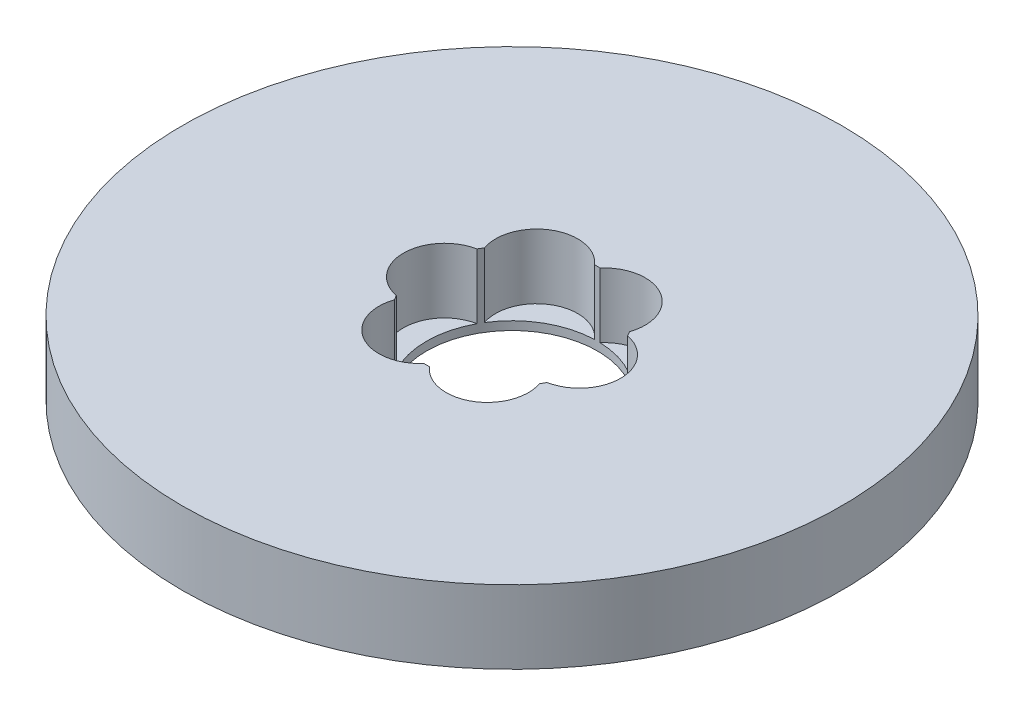
ISO-10303-21;
HEADER;
FILE_DESCRIPTION(('STEP AP214'),'2;1');
FILE_NAME('part.step','',(''),(''),'','','');
FILE_SCHEMA(('AUTOMOTIVE_DESIGN { 1 0 10303 214 1 1 1 1 }'));
ENDSEC;
DATA;
#1=APPLICATION_CONTEXT('core data for automotive mechanical design processes');
#2=APPLICATION_PROTOCOL_DEFINITION('international standard','automotive_design',2000,#1);
#3=PRODUCT_CONTEXT('',#1,'mechanical');
#4=PRODUCT('Part','Part','',(#3));
#5=PRODUCT_RELATED_PRODUCT_CATEGORY('part','',(#4));
#6=PRODUCT_DEFINITION_FORMATION('','',#4);
#7=PRODUCT_DEFINITION_CONTEXT('part definition',#1,'design');
#8=PRODUCT_DEFINITION('design','',#6,#7);
#9=PRODUCT_DEFINITION_SHAPE('','',#8);
#10=(LENGTH_UNIT() NAMED_UNIT(*) SI_UNIT(.MILLI.,.METRE.));
#11=(NAMED_UNIT(*) PLANE_ANGLE_UNIT() SI_UNIT($,.RADIAN.));
#12=(NAMED_UNIT(*) SI_UNIT($,.STERADIAN.) SOLID_ANGLE_UNIT());
#13=UNCERTAINTY_MEASURE_WITH_UNIT(LENGTH_MEASURE(1.E-05),#10,'distance_accuracy_value','');
#14=(GEOMETRIC_REPRESENTATION_CONTEXT(3) GLOBAL_UNCERTAINTY_ASSIGNED_CONTEXT((#13)) GLOBAL_UNIT_ASSIGNED_CONTEXT((#10,
#11,#12)) REPRESENTATION_CONTEXT('',''));
#15=CARTESIAN_POINT('',(0.,0.,0.));
#16=DIRECTION('',(0.,0.,1.));
#17=DIRECTION('',(1.,0.,0.));
#18=AXIS2_PLACEMENT_3D('',#15,#16,#17);
#19=CARTESIAN_POINT('',(0.,15.,0.));
#20=DIRECTION('',(0.,-1.,0.));
#21=DIRECTION('',(0.,0.,-1.));
#22=AXIS2_PLACEMENT_3D('',#19,#20,#21);
#23=CYLINDRICAL_SURFACE('',#22,67.5);
#24=CARTESIAN_POINT('',(0.,15.,0.));
#25=DIRECTION('',(0.,1.,0.));
#26=DIRECTION('',(0.,0.,1.));
#27=AXIS2_PLACEMENT_3D('',#24,#25,#26);
#28=CIRCLE('',#27,67.5);
#29=CARTESIAN_POINT('',(0.,15.,67.5));
#30=VERTEX_POINT('',#29);
#31=EDGE_CURVE('E213',#30,#30,#28,.T.);
#32=ORIENTED_EDGE('',*,*,#31,.F.);
#33=EDGE_LOOP('',(#32));
#34=FACE_BOUND('',#33,.T.);
#35=CARTESIAN_POINT('',(0.,0.,0.));
#36=DIRECTION('',(0.,1.,0.));
#37=DIRECTION('',(0.,0.,1.));
#38=AXIS2_PLACEMENT_3D('',#35,#36,#37);
#39=CIRCLE('',#38,67.5);
#40=CARTESIAN_POINT('',(0.,0.,67.5));
#41=VERTEX_POINT('',#40);
#42=EDGE_CURVE('E208',#41,#41,#39,.T.);
#43=ORIENTED_EDGE('',*,*,#42,.T.);
#44=EDGE_LOOP('',(#43));
#45=FACE_BOUND('',#44,.T.);
#46=ADVANCED_FACE('F39',(#34,#45),#23,.T.);
#47=CARTESIAN_POINT('',(0.,15.,0.));
#48=DIRECTION('',(0.,1.,0.));
#49=DIRECTION('',(0.,0.,1.));
#50=AXIS2_PLACEMENT_3D('',#47,#48,#49);
#51=PLANE('',#50);
#52=CARTESIAN_POINT('',(-6.90377986307202,15.,11.9576974871117));
#53=DIRECTION('',(0.,1.,0.));
#54=DIRECTION('',(0.86602540378444,0.,0.499999999999998));
#55=AXIS2_PLACEMENT_3D('',#52,#53,#54);
#56=CIRCLE('',#55,8.42085664225368);
#57=CARTESIAN_POINT('',(-14.8696823620927,15.,9.22727188558292));
#58=VERTEX_POINT('',#57);
#59=CARTESIAN_POINT('',(-0.556210679494311,15.,17.4911586145692));
#60=VERTEX_POINT('',#59);
#61=EDGE_CURVE('E198',#58,#60,#56,.T.);
#62=ORIENTED_EDGE('',*,*,#61,.F.);
#63=CARTESIAN_POINT('',(0.,15.,0.));
#64=DIRECTION('',(0.,1.,0.));
#65=DIRECTION('',(0.,0.,1.));
#66=AXIS2_PLACEMENT_3D('',#63,#64,#65);
#67=CIRCLE('',#66,17.5);
#68=CARTESIAN_POINT('',(-15.4258930415871,15.,8.26388672898626));
#69=VERTEX_POINT('',#68);
#70=EDGE_CURVE('E202',#69,#58,#67,.T.);
#71=ORIENTED_EDGE('',*,*,#70,.F.);
#72=CARTESIAN_POINT('',(-13.8075597261441,15.,0.));
#73=DIRECTION('',(0.,1.,0.));
#74=DIRECTION('',(0.,0.,1.));
#75=AXIS2_PLACEMENT_3D('',#72,#73,#74);
#76=CIRCLE('',#75,8.42085664225368);
#77=CARTESIAN_POINT('',(-15.4258930415871,15.,-8.26388672898626));
#78=VERTEX_POINT('',#77);
#79=EDGE_CURVE('E200',#78,#69,#76,.T.);
#80=ORIENTED_EDGE('',*,*,#79,.F.);
#81=CARTESIAN_POINT('',(-14.8696823620928,15.,-9.22727188558271));
#82=VERTEX_POINT('',#81);
#83=EDGE_CURVE('E209',#82,#78,#67,.T.);
#84=ORIENTED_EDGE('',*,*,#83,.F.);
#85=CARTESIAN_POINT('',(-6.90377986307219,15.,-11.9576974871116));
#86=DIRECTION('',(0.,1.,0.));
#87=DIRECTION('',(-0.866025403784433,0.,0.50000000000001));
#88=AXIS2_PLACEMENT_3D('',#85,#86,#87);
#89=CIRCLE('',#88,8.42085664225368);
#90=CARTESIAN_POINT('',(-0.556210679494557,15.,-17.4911586145691));
#91=VERTEX_POINT('',#90);
#92=EDGE_CURVE('E58',#91,#82,#89,.T.);
#93=ORIENTED_EDGE('',*,*,#92,.F.);
#94=CARTESIAN_POINT('',(0.556210679494191,15.,-17.4911586145692));
#95=VERTEX_POINT('',#94);
#96=EDGE_CURVE('E148',#95,#91,#67,.T.);
#97=ORIENTED_EDGE('',*,*,#96,.F.);
#98=CARTESIAN_POINT('',(6.90377986307194,15.,-11.9576974871118));
#99=DIRECTION('',(0.,1.,0.));
#100=DIRECTION('',(-0.866025403784443,0.,-0.499999999999992));
#101=AXIS2_PLACEMENT_3D('',#98,#99,#100);
#102=CIRCLE('',#101,8.42085664225368);
#103=CARTESIAN_POINT('',(14.8696823620927,15.,-9.22727188558303));
#104=VERTEX_POINT('',#103);
#105=EDGE_CURVE('E137',#104,#95,#102,.T.);
#106=ORIENTED_EDGE('',*,*,#105,.F.);
#107=CARTESIAN_POINT('',(15.4258930415871,15.,-8.26388672898626));
#108=VERTEX_POINT('',#107);
#109=EDGE_CURVE('E446',#108,#104,#67,.T.);
#110=ORIENTED_EDGE('',*,*,#109,.F.);
#111=CARTESIAN_POINT('',(13.8075597261441,15.,0.));
#112=DIRECTION('',(0.,1.,0.));
#113=DIRECTION('',(0.,0.,-1.));
#114=AXIS2_PLACEMENT_3D('',#111,#112,#113);
#115=CIRCLE('',#114,8.42085664225368);
#116=CARTESIAN_POINT('',(15.4258930415871,15.,8.26388672898626));
#117=VERTEX_POINT('',#116);
#118=EDGE_CURVE('E181',#117,#108,#115,.T.);
#119=ORIENTED_EDGE('',*,*,#118,.F.);
#120=CARTESIAN_POINT('',(14.8696823620928,15.,9.22727188558282));
#121=VERTEX_POINT('',#120);
#122=EDGE_CURVE('E441',#121,#117,#67,.T.);
#123=ORIENTED_EDGE('',*,*,#122,.F.);
#124=CARTESIAN_POINT('',(6.9037798630721,15.,11.9576974871117));
#125=DIRECTION('',(0.,1.,0.));
#126=DIRECTION('',(0.866025403784436,0.,-0.500000000000004));
#127=AXIS2_PLACEMENT_3D('',#124,#125,#126);
#128=CIRCLE('',#127,8.42085664225368);
#129=CARTESIAN_POINT('',(0.556210679494434,15.,17.4911586145692));
#130=VERTEX_POINT('',#129);
#131=EDGE_CURVE('E191',#130,#121,#128,.T.);
#132=ORIENTED_EDGE('',*,*,#131,.F.);
#133=EDGE_CURVE('E207',#60,#130,#67,.T.);
#134=ORIENTED_EDGE('',*,*,#133,.F.);
#135=EDGE_LOOP('',(#62,#71,#80,#84,#93,#97,#106,#110,#119,#123,#132,#134));
#136=FACE_BOUND('',#135,.T.);
#137=ORIENTED_EDGE('',*,*,#31,.T.);
#138=EDGE_LOOP('',(#137));
#139=FACE_BOUND('',#138,.T.);
#140=ADVANCED_FACE('F237',(#136,#139),#51,.T.);
#141=CARTESIAN_POINT('',(0.,0.,0.));
#142=DIRECTION('',(0.,1.,0.));
#143=DIRECTION('',(0.,0.,1.));
#144=AXIS2_PLACEMENT_3D('',#141,#142,#143);
#145=PLANE('',#144);
#146=CARTESIAN_POINT('',(0.,0.,0.));
#147=DIRECTION('',(0.,1.,0.));
#148=DIRECTION('',(0.,0.,1.));
#149=AXIS2_PLACEMENT_3D('',#146,#147,#148);
#150=CIRCLE('',#149,17.5);
#151=CARTESIAN_POINT('',(0.,0.,17.5));
#152=VERTEX_POINT('',#151);
#153=EDGE_CURVE('E201',#152,#152,#150,.T.);
#154=ORIENTED_EDGE('',*,*,#153,.T.);
#155=EDGE_LOOP('',(#154));
#156=FACE_BOUND('',#155,.T.);
#157=ORIENTED_EDGE('',*,*,#42,.F.);
#158=EDGE_LOOP('',(#157));
#159=FACE_BOUND('',#158,.T.);
#160=ADVANCED_FACE('F258',(#156,#159),#145,.F.);
#161=CARTESIAN_POINT('',(0.,15.,0.));
#162=DIRECTION('',(0.,-1.,0.));
#163=DIRECTION('',(0.,0.,-1.));
#164=AXIS2_PLACEMENT_3D('',#161,#162,#163);
#165=CYLINDRICAL_SURFACE('',#164,17.5);
#166=DIRECTION('',(0.,1.,0.));
#167=VECTOR('',#166,1.);
#168=CARTESIAN_POINT('',(-14.8696823620927,8.37244263671598,9.22727188558292));
#169=LINE('',#168,#167);
#170=CARTESIAN_POINT('',(-14.8696823620927,1.74488527343197,9.22727188558292));
#171=VERTEX_POINT('',#170);
#172=EDGE_CURVE('E11',#171,#58,#169,.T.);
#173=ORIENTED_EDGE('',*,*,#172,.F.);
#174=CARTESIAN_POINT('',(0.,1.74488527343197,0.));
#175=DIRECTION('',(0.,1.,0.));
#176=DIRECTION('',(0.,0.,1.));
#177=AXIS2_PLACEMENT_3D('',#174,#175,#176);
#178=CIRCLE('',#177,17.5);
#179=CARTESIAN_POINT('',(-0.556210679494311,1.74488527343197,17.4911586145692));
#180=VERTEX_POINT('',#179);
#181=EDGE_CURVE('E134',#171,#180,#178,.T.);
#182=ORIENTED_EDGE('',*,*,#181,.T.);
#183=DIRECTION('',(0.,1.,0.));
#184=VECTOR('',#183,1.);
#185=CARTESIAN_POINT('',(-0.556210679494311,8.37244263671598,17.4911586145692));
#186=LINE('',#185,#184);
#187=EDGE_CURVE('E46',#60,#180,#186,.F.);
#188=ORIENTED_EDGE('',*,*,#187,.F.);
#189=ORIENTED_EDGE('',*,*,#133,.T.);
#190=DIRECTION('',(0.,1.,0.));
#191=VECTOR('',#190,1.);
#192=CARTESIAN_POINT('',(0.556210679494433,8.37244263671598,17.4911586145691));
#193=LINE('',#192,#191);
#194=CARTESIAN_POINT('',(0.556210679494434,1.74488527343197,17.4911586145692));
#195=VERTEX_POINT('',#194);
#196=EDGE_CURVE('E165',#195,#130,#193,.T.);
#197=ORIENTED_EDGE('',*,*,#196,.F.);
#198=CARTESIAN_POINT('',(14.8696823620928,1.74488527343197,9.22727188558282));
#199=VERTEX_POINT('',#198);
#200=EDGE_CURVE('E161',#195,#199,#178,.T.);
#201=ORIENTED_EDGE('',*,*,#200,.T.);
#202=DIRECTION('',(0.,1.,0.));
#203=VECTOR('',#202,1.);
#204=CARTESIAN_POINT('',(14.8696823620928,8.37244263671598,9.22727188558282));
#205=LINE('',#204,#203);
#206=EDGE_CURVE('E157',#121,#199,#205,.F.);
#207=ORIENTED_EDGE('',*,*,#206,.F.);
#208=ORIENTED_EDGE('',*,*,#122,.T.);
#209=DIRECTION('',(0.,1.,0.));
#210=VECTOR('',#209,1.);
#211=CARTESIAN_POINT('',(15.4258930415871,8.37244263671598,8.26388672898626));
#212=LINE('',#211,#210);
#213=CARTESIAN_POINT('',(15.4258930415871,1.74488527343197,8.26388672898626));
#214=VERTEX_POINT('',#213);
#215=EDGE_CURVE('E160',#214,#117,#212,.T.);
#216=ORIENTED_EDGE('',*,*,#215,.F.);
#217=CARTESIAN_POINT('',(15.4258930415871,1.74488527343197,-8.26388672898626));
#218=VERTEX_POINT('',#217);
#219=EDGE_CURVE('E156',#214,#218,#178,.T.);
#220=ORIENTED_EDGE('',*,*,#219,.T.);
#221=DIRECTION('',(0.,1.,0.));
#222=VECTOR('',#221,1.);
#223=CARTESIAN_POINT('',(15.4258930415871,8.37244263671598,-8.26388672898626));
#224=LINE('',#223,#222);
#225=EDGE_CURVE('E152',#108,#218,#224,.F.);
#226=ORIENTED_EDGE('',*,*,#225,.F.);
#227=ORIENTED_EDGE('',*,*,#109,.T.);
#228=DIRECTION('',(0.,1.,0.));
#229=VECTOR('',#228,1.);
#230=CARTESIAN_POINT('',(14.8696823620927,8.37244263671598,-9.22727188558303));
#231=LINE('',#230,#229);
#232=CARTESIAN_POINT('',(14.8696823620927,1.74488527343197,-9.22727188558303));
#233=VERTEX_POINT('',#232);
#234=EDGE_CURVE('E155',#233,#104,#231,.T.);
#235=ORIENTED_EDGE('',*,*,#234,.F.);
#236=CARTESIAN_POINT('',(0.556210679494191,1.74488527343197,-17.4911586145692));
#237=VERTEX_POINT('',#236);
#238=EDGE_CURVE('E136',#233,#237,#178,.T.);
#239=ORIENTED_EDGE('',*,*,#238,.T.);
#240=DIRECTION('',(0.,1.,0.));
#241=VECTOR('',#240,1.);
#242=CARTESIAN_POINT('',(0.55621067949419,8.37244263671598,-17.4911586145692));
#243=LINE('',#242,#241);
#244=EDGE_CURVE('E150',#95,#237,#243,.F.);
#245=ORIENTED_EDGE('',*,*,#244,.F.);
#246=ORIENTED_EDGE('',*,*,#96,.T.);
#247=DIRECTION('',(0.,1.,0.));
#248=VECTOR('',#247,1.);
#249=CARTESIAN_POINT('',(-0.556210679494557,8.37244263671598,-17.4911586145691));
#250=LINE('',#249,#248);
#251=CARTESIAN_POINT('',(-0.556210679494557,1.74488527343197,-17.4911586145691));
#252=VERTEX_POINT('',#251);
#253=EDGE_CURVE('E135',#252,#91,#250,.T.);
#254=ORIENTED_EDGE('',*,*,#253,.F.);
#255=CARTESIAN_POINT('',(-14.8696823620928,1.74488527343197,-9.22727188558272));
#256=VERTEX_POINT('',#255);
#257=EDGE_CURVE('E127',#252,#256,#178,.T.);
#258=ORIENTED_EDGE('',*,*,#257,.T.);
#259=DIRECTION('',(0.,1.,0.));
#260=VECTOR('',#259,1.);
#261=CARTESIAN_POINT('',(-14.8696823620928,8.37244263671598,-9.22727188558272));
#262=LINE('',#261,#260);
#263=EDGE_CURVE('E132',#82,#256,#262,.F.);
#264=ORIENTED_EDGE('',*,*,#263,.F.);
#265=ORIENTED_EDGE('',*,*,#83,.T.);
#266=DIRECTION('',(0.,1.,0.));
#267=VECTOR('',#266,1.);
#268=CARTESIAN_POINT('',(-15.4258930415871,8.37244263671598,-8.26388672898626));
#269=LINE('',#268,#267);
#270=CARTESIAN_POINT('',(-15.4258930415871,1.74488527343197,-8.26388672898626));
#271=VERTEX_POINT('',#270);
#272=EDGE_CURVE('E221',#271,#78,#269,.T.);
#273=ORIENTED_EDGE('',*,*,#272,.F.);
#274=CARTESIAN_POINT('',(0.,1.74488527343197,0.));
#275=DIRECTION('',(0.,1.,0.));
#276=DIRECTION('',(0.,0.,1.));
#277=AXIS2_PLACEMENT_3D('',#274,#275,#276);
#278=CIRCLE('',#277,17.5);
#279=CARTESIAN_POINT('',(-15.4258930415871,1.74488527343197,8.26388672898626));
#280=VERTEX_POINT('',#279);
#281=EDGE_CURVE('E216',#271,#280,#278,.T.);
#282=ORIENTED_EDGE('',*,*,#281,.T.);
#283=DIRECTION('',(0.,1.,0.));
#284=VECTOR('',#283,1.);
#285=CARTESIAN_POINT('',(-15.4258930415871,8.37244263671598,8.26388672898626));
#286=LINE('',#285,#284);
#287=EDGE_CURVE('E222',#69,#280,#286,.F.);
#288=ORIENTED_EDGE('',*,*,#287,.F.);
#289=ORIENTED_EDGE('',*,*,#70,.T.);
#290=EDGE_LOOP('',(#173,#182,#188,#189,#197,#201,#207,#208,#216,#220,#226,#227,#235,#239,#245,
#246,#254,#258,#264,#265,#273,#282,#288,#289));
#291=FACE_BOUND('',#290,.T.);
#292=ORIENTED_EDGE('',*,*,#153,.F.);
#293=EDGE_LOOP('',(#292));
#294=FACE_BOUND('',#293,.T.);
#295=ADVANCED_FACE('F142',(#291,#294),#165,.F.);
#296=CARTESIAN_POINT('',(-13.8075597261441,1.74488527343197,0.));
#297=DIRECTION('',(0.,1.,0.));
#298=DIRECTION('',(0.,0.,1.));
#299=AXIS2_PLACEMENT_3D('',#296,#297,#298);
#300=CYLINDRICAL_SURFACE('',#299,8.42085664225368);
#301=ORIENTED_EDGE('',*,*,#272,.T.);
#302=ORIENTED_EDGE('',*,*,#79,.T.);
#303=ORIENTED_EDGE('',*,*,#287,.T.);
#304=CARTESIAN_POINT('',(-13.8075597261441,1.74488527343197,0.));
#305=DIRECTION('',(0.,1.,0.));
#306=DIRECTION('',(0.,0.,1.));
#307=AXIS2_PLACEMENT_3D('',#304,#305,#306);
#308=CIRCLE('',#307,8.42085664225368);
#309=EDGE_CURVE('E203',#271,#280,#308,.T.);
#310=ORIENTED_EDGE('',*,*,#309,.F.);
#311=EDGE_LOOP('',(#301,#302,#303,#310));
#312=FACE_BOUND('',#311,.T.);
#313=ADVANCED_FACE('F229',(#312),#300,.F.);
#314=CARTESIAN_POINT('',(-13.8075597261441,1.74488527343197,0.));
#315=DIRECTION('',(0.,1.,0.));
#316=DIRECTION('',(0.,0.,1.));
#317=AXIS2_PLACEMENT_3D('',#314,#315,#316);
#318=PLANE('',#317);
#319=ORIENTED_EDGE('',*,*,#309,.T.);
#320=ORIENTED_EDGE('',*,*,#281,.F.);
#321=EDGE_LOOP('',(#319,#320));
#322=FACE_BOUND('',#321,.T.);
#323=ADVANCED_FACE('F238',(#322),#318,.T.);
#324=CARTESIAN_POINT('',(-6.90377986307219,1.74488527343197,-11.9576974871116));
#325=DIRECTION('',(0.,1.,0.));
#326=DIRECTION('',(0.,0.,1.));
#327=AXIS2_PLACEMENT_3D('',#324,#325,#326);
#328=CYLINDRICAL_SURFACE('',#327,8.42085664225368);
#329=ORIENTED_EDGE('',*,*,#253,.T.);
#330=ORIENTED_EDGE('',*,*,#92,.T.);
#331=ORIENTED_EDGE('',*,*,#263,.T.);
#332=CARTESIAN_POINT('',(-6.90377986307219,1.74488527343197,-11.9576974871116));
#333=DIRECTION('',(0.,1.,0.));
#334=DIRECTION('',(-0.866025403784433,0.,0.50000000000001));
#335=AXIS2_PLACEMENT_3D('',#332,#333,#334);
#336=CIRCLE('',#335,8.42085664225368);
#337=EDGE_CURVE('E129',#252,#256,#336,.T.);
#338=ORIENTED_EDGE('',*,*,#337,.F.);
#339=EDGE_LOOP('',(#329,#330,#331,#338));
#340=FACE_BOUND('',#339,.T.);
#341=ADVANCED_FACE('F140',(#340),#328,.F.);
#342=CARTESIAN_POINT('',(-6.90377986307202,1.74488527343197,11.9576974871117));
#343=DIRECTION('',(0.,1.,0.));
#344=DIRECTION('',(0.86602540378444,0.,0.499999999999998));
#345=AXIS2_PLACEMENT_3D('',#342,#343,#344);
#346=PLANE('',#345);
#347=ORIENTED_EDGE('',*,*,#337,.T.);
#348=ORIENTED_EDGE('',*,*,#257,.F.);
#349=EDGE_LOOP('',(#347,#348));
#350=FACE_BOUND('',#349,.T.);
#351=ADVANCED_FACE('F126',(#350),#346,.T.);
#352=CARTESIAN_POINT('',(6.90377986307194,1.74488527343197,-11.9576974871118));
#353=DIRECTION('',(0.,1.,0.));
#354=DIRECTION('',(0.,0.,1.));
#355=AXIS2_PLACEMENT_3D('',#352,#353,#354);
#356=CYLINDRICAL_SURFACE('',#355,8.42085664225368);
#357=ORIENTED_EDGE('',*,*,#234,.T.);
#358=ORIENTED_EDGE('',*,*,#105,.T.);
#359=ORIENTED_EDGE('',*,*,#244,.T.);
#360=CARTESIAN_POINT('',(6.90377986307194,1.74488527343197,-11.9576974871118));
#361=DIRECTION('',(0.,1.,0.));
#362=DIRECTION('',(-0.866025403784443,0.,-0.499999999999992));
#363=AXIS2_PLACEMENT_3D('',#360,#361,#362);
#364=CIRCLE('',#363,8.42085664225368);
#365=EDGE_CURVE('E178',#233,#237,#364,.T.);
#366=ORIENTED_EDGE('',*,*,#365,.F.);
#367=EDGE_LOOP('',(#357,#358,#359,#366));
#368=FACE_BOUND('',#367,.T.);
#369=ADVANCED_FACE('F182',(#368),#356,.F.);
#370=ORIENTED_EDGE('',*,*,#365,.T.);
#371=ORIENTED_EDGE('',*,*,#238,.F.);
#372=EDGE_LOOP('',(#370,#371));
#373=FACE_BOUND('',#372,.T.);
#374=ADVANCED_FACE('F177',(#373),#346,.T.);
#375=CARTESIAN_POINT('',(13.8075597261441,1.74488527343197,0.));
#376=DIRECTION('',(0.,1.,0.));
#377=DIRECTION('',(0.,0.,1.));
#378=AXIS2_PLACEMENT_3D('',#375,#376,#377);
#379=CYLINDRICAL_SURFACE('',#378,8.42085664225368);
#380=ORIENTED_EDGE('',*,*,#215,.T.);
#381=ORIENTED_EDGE('',*,*,#118,.T.);
#382=ORIENTED_EDGE('',*,*,#225,.T.);
#383=CARTESIAN_POINT('',(13.8075597261441,1.74488527343197,0.));
#384=DIRECTION('',(0.,1.,0.));
#385=DIRECTION('',(0.,0.,-1.));
#386=AXIS2_PLACEMENT_3D('',#383,#384,#385);
#387=CIRCLE('',#386,8.42085664225368);
#388=EDGE_CURVE('E183',#214,#218,#387,.T.);
#389=ORIENTED_EDGE('',*,*,#388,.F.);
#390=EDGE_LOOP('',(#380,#381,#382,#389));
#391=FACE_BOUND('',#390,.T.);
#392=ADVANCED_FACE('F305',(#391),#379,.F.);
#393=ORIENTED_EDGE('',*,*,#388,.T.);
#394=ORIENTED_EDGE('',*,*,#219,.F.);
#395=EDGE_LOOP('',(#393,#394));
#396=FACE_BOUND('',#395,.T.);
#397=ADVANCED_FACE('F302',(#396),#346,.T.);
#398=CARTESIAN_POINT('',(6.9037798630721,1.74488527343197,11.9576974871117));
#399=DIRECTION('',(0.,1.,0.));
#400=DIRECTION('',(0.,0.,1.));
#401=AXIS2_PLACEMENT_3D('',#398,#399,#400);
#402=CYLINDRICAL_SURFACE('',#401,8.42085664225368);
#403=ORIENTED_EDGE('',*,*,#196,.T.);
#404=ORIENTED_EDGE('',*,*,#131,.T.);
#405=ORIENTED_EDGE('',*,*,#206,.T.);
#406=CARTESIAN_POINT('',(6.9037798630721,1.74488527343197,11.9576974871117));
#407=DIRECTION('',(0.,1.,0.));
#408=DIRECTION('',(0.866025403784436,0.,-0.500000000000004));
#409=AXIS2_PLACEMENT_3D('',#406,#407,#408);
#410=CIRCLE('',#409,8.42085664225368);
#411=EDGE_CURVE('E192',#195,#199,#410,.T.);
#412=ORIENTED_EDGE('',*,*,#411,.F.);
#413=EDGE_LOOP('',(#403,#404,#405,#412));
#414=FACE_BOUND('',#413,.T.);
#415=ADVANCED_FACE('F317',(#414),#402,.F.);
#416=ORIENTED_EDGE('',*,*,#411,.T.);
#417=ORIENTED_EDGE('',*,*,#200,.F.);
#418=EDGE_LOOP('',(#416,#417));
#419=FACE_BOUND('',#418,.T.);
#420=ADVANCED_FACE('F321',(#419),#346,.T.);
#421=CARTESIAN_POINT('',(-6.90377986307202,1.74488527343197,11.9576974871117));
#422=DIRECTION('',(0.,1.,0.));
#423=DIRECTION('',(0.,0.,1.));
#424=AXIS2_PLACEMENT_3D('',#421,#422,#423);
#425=CYLINDRICAL_SURFACE('',#424,8.42085664225368);
#426=ORIENTED_EDGE('',*,*,#172,.T.);
#427=ORIENTED_EDGE('',*,*,#61,.T.);
#428=ORIENTED_EDGE('',*,*,#187,.T.);
#429=CARTESIAN_POINT('',(-6.90377986307202,1.74488527343197,11.9576974871117));
#430=DIRECTION('',(0.,1.,0.));
#431=DIRECTION('',(0.86602540378444,0.,0.499999999999998));
#432=AXIS2_PLACEMENT_3D('',#429,#430,#431);
#433=CIRCLE('',#432,8.42085664225368);
#434=EDGE_CURVE('E55',#171,#180,#433,.T.);
#435=ORIENTED_EDGE('',*,*,#434,.F.);
#436=EDGE_LOOP('',(#426,#427,#428,#435));
#437=FACE_BOUND('',#436,.T.);
#438=ADVANCED_FACE('F340',(#437),#425,.F.);
#439=ORIENTED_EDGE('',*,*,#434,.T.);
#440=ORIENTED_EDGE('',*,*,#181,.F.);
#441=EDGE_LOOP('',(#439,#440));
#442=FACE_BOUND('',#441,.T.);
#443=ADVANCED_FACE('F290',(#442),#346,.T.);
#444=CLOSED_SHELL('',(#46,#140,#160,#295,#313,#323,#341,#351,#369,#374,#392,#397,#415,#420,#438,#443));
#445=MANIFOLD_SOLID_BREP('B2',#444);
#446=ADVANCED_BREP_SHAPE_REPRESENTATION('',(#18,#445),#14);
#447=SHAPE_DEFINITION_REPRESENTATION(#9,#446);
ENDSEC;
END-ISO-10303-21;
